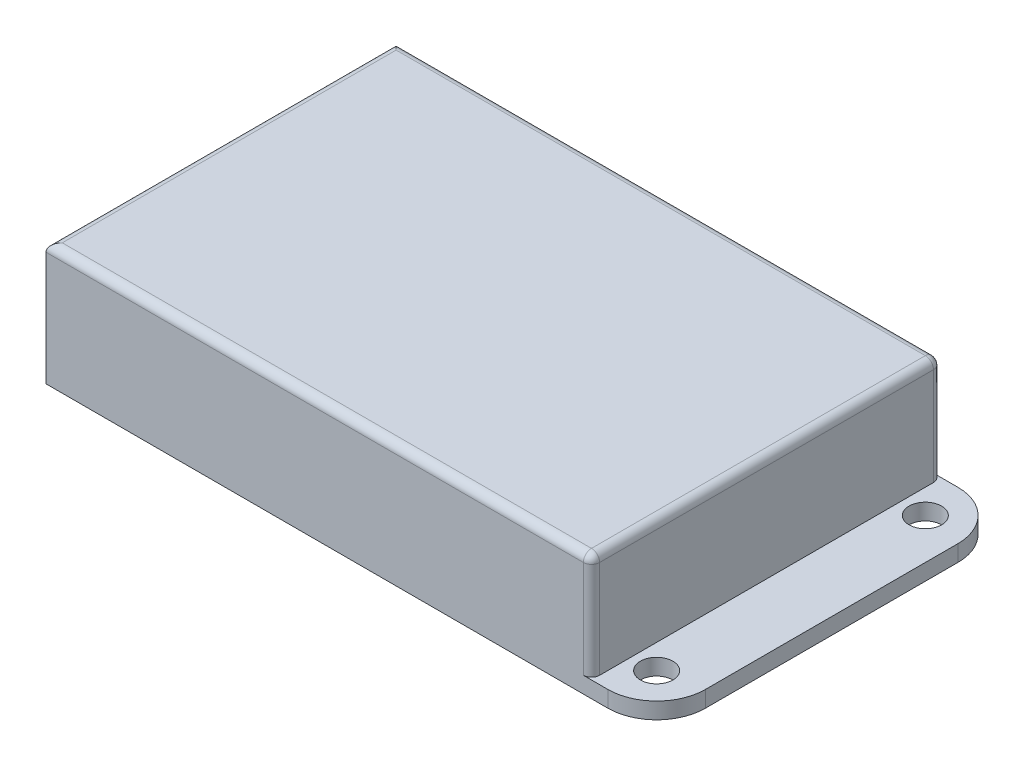
ISO-10303-21;
HEADER;
FILE_DESCRIPTION(('STEP AP214'),'2;1');
FILE_NAME('part.step','',(''),(''),'','','');
FILE_SCHEMA(('AUTOMOTIVE_DESIGN { 1 0 10303 214 1 1 1 1 }'));
ENDSEC;
DATA;
#1=APPLICATION_CONTEXT('core data for automotive mechanical design processes');
#2=APPLICATION_PROTOCOL_DEFINITION('international standard','automotive_design',2000,#1);
#3=PRODUCT_CONTEXT('',#1,'mechanical');
#4=PRODUCT('Part','Part','',(#3));
#5=PRODUCT_RELATED_PRODUCT_CATEGORY('part','',(#4));
#6=PRODUCT_DEFINITION_FORMATION('','',#4);
#7=PRODUCT_DEFINITION_CONTEXT('part definition',#1,'design');
#8=PRODUCT_DEFINITION('design','',#6,#7);
#9=PRODUCT_DEFINITION_SHAPE('','',#8);
#10=(LENGTH_UNIT() NAMED_UNIT(*) SI_UNIT(.MILLI.,.METRE.));
#11=(NAMED_UNIT(*) PLANE_ANGLE_UNIT() SI_UNIT($,.RADIAN.));
#12=(NAMED_UNIT(*) SI_UNIT($,.STERADIAN.) SOLID_ANGLE_UNIT());
#13=UNCERTAINTY_MEASURE_WITH_UNIT(LENGTH_MEASURE(1.E-05),#10,'distance_accuracy_value','');
#14=(GEOMETRIC_REPRESENTATION_CONTEXT(3) GLOBAL_UNCERTAINTY_ASSIGNED_CONTEXT((#13)) GLOBAL_UNIT_ASSIGNED_CONTEXT((#10,
#11,#12)) REPRESENTATION_CONTEXT('',''));
#15=CARTESIAN_POINT('',(0.,0.,0.));
#16=DIRECTION('',(0.,0.,1.));
#17=DIRECTION('',(1.,0.,0.));
#18=AXIS2_PLACEMENT_3D('',#15,#16,#17);
#19=CARTESIAN_POINT('',(0.,2.,0.));
#20=DIRECTION('',(0.,1.,0.));
#21=DIRECTION('',(0.,0.,1.));
#22=AXIS2_PLACEMENT_3D('',#19,#20,#21);
#23=PLANE('',#22);
#24=CARTESIAN_POINT('',(5.,2.,21.500000001011));
#25=DIRECTION('',(0.,1.,0.));
#26=DIRECTION('',(0.,0.,1.));
#27=AXIS2_PLACEMENT_3D('',#24,#25,#26);
#28=CIRCLE('',#27,2.);
#29=CARTESIAN_POINT('',(5.,2.,23.500000001011));
#30=VERTEX_POINT('',#29);
#31=EDGE_CURVE('E331',#30,#30,#28,.T.);
#32=ORIENTED_EDGE('',*,*,#31,.F.);
#33=EDGE_LOOP('',(#32));
#34=FACE_BOUND('',#33,.T.);
#35=DIRECTION('',(0.,0.,1.));
#36=VECTOR('',#35,1.);
#37=CARTESIAN_POINT('',(10.,2.,0.));
#38=LINE('',#37,#36);
#39=CARTESIAN_POINT('',(10.,2.,0.));
#40=VERTEX_POINT('',#39);
#41=CARTESIAN_POINT('',(10.,2.,43.));
#42=VERTEX_POINT('',#41);
#43=EDGE_CURVE('E142',#40,#42,#38,.T.);
#44=ORIENTED_EDGE('',*,*,#43,.F.);
#45=CARTESIAN_POINT('',(10.,2.,0.));
#46=CARTESIAN_POINT('',(-10.,2.,21.5));
#47=CARTESIAN_POINT('',(10.,2.,43.));
#48=B_SPLINE_CURVE_WITH_KNOTS('',2,(#45,#46,#47),.UNSPECIFIED.,.F.,.F.,(3,3),(0.,1.),.UNSPECIFIED.);
#49=EDGE_CURVE('E155',#40,#42,#48,.T.);
#50=ORIENTED_EDGE('',*,*,#49,.T.);
#51=EDGE_LOOP('',(#44,#50));
#52=FACE_BOUND('',#51,.T.);
#53=ADVANCED_FACE('F43',(#34,#52),#23,.T.);
#54=CARTESIAN_POINT('',(0.,2.,0.));
#55=DIRECTION('',(0.,0.,-1.));
#56=DIRECTION('',(-1.,0.,0.));
#57=AXIS2_PLACEMENT_3D('',#54,#55,#56);
#58=PLANE('',#57);
#59=DIRECTION('',(0.,-1.,0.));
#60=VECTOR('',#59,1.);
#61=CARTESIAN_POINT('',(10.,15.,0.));
#62=LINE('',#61,#60);
#63=CARTESIAN_POINT('',(10.,14.,0.));
#64=VERTEX_POINT('',#63);
#65=EDGE_CURVE('E138',#64,#40,#62,.T.);
#66=ORIENTED_EDGE('',*,*,#65,.F.);
#67=DIRECTION('',(-1.,0.,0.));
#68=VECTOR('',#67,1.);
#69=CARTESIAN_POINT('',(0.,14.,0.));
#70=LINE('',#69,#68);
#71=CARTESIAN_POINT('',(76.,14.,0.));
#72=VERTEX_POINT('',#71);
#73=EDGE_CURVE('E295',#64,#72,#70,.F.);
#74=ORIENTED_EDGE('',*,*,#73,.T.);
#75=DIRECTION('',(0.,-1.,0.));
#76=VECTOR('',#75,1.);
#77=CARTESIAN_POINT('',(76.,2.,0.));
#78=LINE('',#77,#76);
#79=CARTESIAN_POINT('',(76.,2.,0.));
#80=VERTEX_POINT('',#79);
#81=EDGE_CURVE('E292',#72,#80,#78,.T.);
#82=ORIENTED_EDGE('',*,*,#81,.T.);
#83=DIRECTION('',(1.,0.,0.));
#84=VECTOR('',#83,1.);
#85=CARTESIAN_POINT('',(0.,2.,0.));
#86=LINE('',#85,#84);
#87=CARTESIAN_POINT('',(79.,2.,0.));
#88=VERTEX_POINT('',#87);
#89=EDGE_CURVE('E172',#80,#88,#86,.T.);
#90=ORIENTED_EDGE('',*,*,#89,.T.);
#91=DIRECTION('',(0.,-1.,0.));
#92=VECTOR('',#91,1.);
#93=CARTESIAN_POINT('',(79.,2.,0.));
#94=LINE('',#93,#92);
#95=CARTESIAN_POINT('',(79.,0.,0.));
#96=VERTEX_POINT('',#95);
#97=EDGE_CURVE('E167',#88,#96,#94,.T.);
#98=ORIENTED_EDGE('',*,*,#97,.T.);
#99=DIRECTION('',(1.,0.,0.));
#100=VECTOR('',#99,1.);
#101=CARTESIAN_POINT('',(0.,0.,0.));
#102=LINE('',#101,#100);
#103=CARTESIAN_POINT('',(10.,0.,0.));
#104=VERTEX_POINT('',#103);
#105=EDGE_CURVE('E164',#104,#96,#102,.T.);
#106=ORIENTED_EDGE('',*,*,#105,.F.);
#107=DIRECTION('',(0.,-1.,0.));
#108=VECTOR('',#107,1.);
#109=CARTESIAN_POINT('',(10.,2.,0.));
#110=LINE('',#109,#108);
#111=EDGE_CURVE('E160',#40,#104,#110,.T.);
#112=ORIENTED_EDGE('',*,*,#111,.F.);
#113=EDGE_LOOP('',(#66,#74,#82,#90,#98,#106,#112));
#114=FACE_BOUND('',#113,.T.);
#115=ADVANCED_FACE('F161',(#114),#58,.T.);
#116=DIRECTION('',(0.,-1.,0.));
#117=VECTOR('',#116,1.);
#118=SURFACE_OF_LINEAR_EXTRUSION('',#48,#117);
#119=CARTESIAN_POINT('',(10.,0.,0.));
#120=CARTESIAN_POINT('',(-10.,0.,21.5));
#121=CARTESIAN_POINT('',(10.,0.,43.));
#122=B_SPLINE_CURVE_WITH_KNOTS('',2,(#119,#120,#121),.UNSPECIFIED.,.F.,.F.,(3,3),(0.,1.),.UNSPECIFIED.);
#123=CARTESIAN_POINT('',(10.,0.,43.));
#124=VERTEX_POINT('',#123);
#125=EDGE_CURVE('E341',#104,#124,#122,.T.);
#126=ORIENTED_EDGE('',*,*,#125,.T.);
#127=DIRECTION('',(0.,-1.,0.));
#128=VECTOR('',#127,1.);
#129=CARTESIAN_POINT('',(10.,2.,43.));
#130=LINE('',#129,#128);
#131=EDGE_CURVE('E168',#42,#124,#130,.T.);
#132=ORIENTED_EDGE('',*,*,#131,.F.);
#133=ORIENTED_EDGE('',*,*,#49,.F.);
#134=ORIENTED_EDGE('',*,*,#111,.T.);
#135=EDGE_LOOP('',(#126,#132,#133,#134));
#136=FACE_BOUND('',#135,.T.);
#137=ADVANCED_FACE('F170',(#136),#118,.F.);
#138=CARTESIAN_POINT('',(0.,2.,43.));
#139=DIRECTION('',(0.,0.,-1.));
#140=DIRECTION('',(-1.,0.,0.));
#141=AXIS2_PLACEMENT_3D('',#138,#139,#140);
#142=PLANE('',#141);
#143=DIRECTION('',(0.,-1.,0.));
#144=VECTOR('',#143,1.);
#145=CARTESIAN_POINT('',(76.,2.,43.));
#146=LINE('',#145,#144);
#147=CARTESIAN_POINT('',(76.,2.,43.));
#148=VERTEX_POINT('',#147);
#149=CARTESIAN_POINT('',(76.,14.,43.));
#150=VERTEX_POINT('',#149);
#151=EDGE_CURVE('E60',#148,#150,#146,.F.);
#152=ORIENTED_EDGE('',*,*,#151,.T.);
#153=DIRECTION('',(1.,0.,0.));
#154=VECTOR('',#153,1.);
#155=CARTESIAN_POINT('',(10.,14.,43.));
#156=LINE('',#155,#154);
#157=CARTESIAN_POINT('',(10.,14.,43.));
#158=VERTEX_POINT('',#157);
#159=EDGE_CURVE('E304',#150,#158,#156,.F.);
#160=ORIENTED_EDGE('',*,*,#159,.T.);
#161=DIRECTION('',(0.,-1.,0.));
#162=VECTOR('',#161,1.);
#163=CARTESIAN_POINT('',(10.,15.,43.));
#164=LINE('',#163,#162);
#165=EDGE_CURVE('E149',#158,#42,#164,.T.);
#166=ORIENTED_EDGE('',*,*,#165,.T.);
#167=ORIENTED_EDGE('',*,*,#131,.T.);
#168=DIRECTION('',(1.,0.,0.));
#169=VECTOR('',#168,1.);
#170=CARTESIAN_POINT('',(0.,0.,43.));
#171=LINE('',#170,#169);
#172=CARTESIAN_POINT('',(79.,0.,43.));
#173=VERTEX_POINT('',#172);
#174=EDGE_CURVE('E344',#124,#173,#171,.T.);
#175=ORIENTED_EDGE('',*,*,#174,.T.);
#176=DIRECTION('',(0.,-1.,0.));
#177=VECTOR('',#176,1.);
#178=CARTESIAN_POINT('',(79.,2.,43.));
#179=LINE('',#178,#177);
#180=CARTESIAN_POINT('',(79.,2.,43.));
#181=VERTEX_POINT('',#180);
#182=EDGE_CURVE('E277',#173,#181,#179,.F.);
#183=ORIENTED_EDGE('',*,*,#182,.T.);
#184=DIRECTION('',(1.,0.,0.));
#185=VECTOR('',#184,1.);
#186=CARTESIAN_POINT('',(0.,2.,43.));
#187=LINE('',#186,#185);
#188=EDGE_CURVE('E65',#148,#181,#187,.T.);
#189=ORIENTED_EDGE('',*,*,#188,.F.);
#190=EDGE_LOOP('',(#152,#160,#166,#167,#175,#183,#189));
#191=FACE_BOUND('',#190,.T.);
#192=ADVANCED_FACE('F191',(#191),#142,.F.);
#193=CARTESIAN_POINT('',(85.,2.,0.));
#194=DIRECTION('',(1.,0.,0.));
#195=DIRECTION('',(0.,0.,-1.));
#196=AXIS2_PLACEMENT_3D('',#193,#194,#195);
#197=PLANE('',#196);
#198=DIRECTION('',(0.,0.,1.));
#199=VECTOR('',#198,1.);
#200=CARTESIAN_POINT('',(85.,0.,0.));
#201=LINE('',#200,#199);
#202=CARTESIAN_POINT('',(85.,0.,6.));
#203=VERTEX_POINT('',#202);
#204=CARTESIAN_POINT('',(85.,0.,37.));
#205=VERTEX_POINT('',#204);
#206=EDGE_CURVE('E177',#203,#205,#201,.T.);
#207=ORIENTED_EDGE('',*,*,#206,.F.);
#208=DIRECTION('',(0.,-1.,0.));
#209=VECTOR('',#208,1.);
#210=CARTESIAN_POINT('',(85.,2.,6.));
#211=LINE('',#210,#209);
#212=CARTESIAN_POINT('',(85.,2.,6.));
#213=VERTEX_POINT('',#212);
#214=EDGE_CURVE('E276',#203,#213,#211,.F.);
#215=ORIENTED_EDGE('',*,*,#214,.T.);
#216=DIRECTION('',(0.,0.,1.));
#217=VECTOR('',#216,1.);
#218=CARTESIAN_POINT('',(85.,2.,0.));
#219=LINE('',#218,#217);
#220=CARTESIAN_POINT('',(85.,2.,37.));
#221=VERTEX_POINT('',#220);
#222=EDGE_CURVE('E174',#213,#221,#219,.T.);
#223=ORIENTED_EDGE('',*,*,#222,.T.);
#224=DIRECTION('',(0.,-1.,0.));
#225=VECTOR('',#224,1.);
#226=CARTESIAN_POINT('',(85.,0.,37.));
#227=LINE('',#226,#225);
#228=EDGE_CURVE('E362',#221,#205,#227,.T.);
#229=ORIENTED_EDGE('',*,*,#228,.T.);
#230=EDGE_LOOP('',(#207,#215,#223,#229));
#231=FACE_BOUND('',#230,.T.);
#232=ADVANCED_FACE('F248',(#231),#197,.T.);
#233=CARTESIAN_POINT('',(80.,2.,5.));
#234=DIRECTION('',(0.,1.,0.));
#235=DIRECTION('',(0.,0.,1.));
#236=AXIS2_PLACEMENT_3D('',#233,#234,#235);
#237=CIRCLE('',#236,2.);
#238=CARTESIAN_POINT('',(80.,2.,6.99999999999999));
#239=VERTEX_POINT('',#238);
#240=EDGE_CURVE('E261',#239,#239,#237,.T.);
#241=ORIENTED_EDGE('',*,*,#240,.F.);
#242=EDGE_LOOP('',(#241));
#243=FACE_BOUND('',#242,.T.);
#244=CARTESIAN_POINT('',(80.,2.,38.));
#245=DIRECTION('',(0.,1.,0.));
#246=DIRECTION('',(0.,0.,1.));
#247=AXIS2_PLACEMENT_3D('',#244,#245,#246);
#248=CIRCLE('',#247,2.);
#249=CARTESIAN_POINT('',(80.,2.,40.));
#250=VERTEX_POINT('',#249);
#251=EDGE_CURVE('E265',#250,#250,#248,.T.);
#252=ORIENTED_EDGE('',*,*,#251,.F.);
#253=EDGE_LOOP('',(#252));
#254=FACE_BOUND('',#253,.T.);
#255=ORIENTED_EDGE('',*,*,#222,.F.);
#256=CARTESIAN_POINT('',(79.,2.,6.));
#257=DIRECTION('',(0.,1.,0.));
#258=DIRECTION('',(0.,0.,1.));
#259=AXIS2_PLACEMENT_3D('',#256,#257,#258);
#260=CIRCLE('',#259,6.);
#261=EDGE_CURVE('E269',#213,#88,#260,.T.);
#262=ORIENTED_EDGE('',*,*,#261,.T.);
#263=ORIENTED_EDGE('',*,*,#89,.F.);
#264=CARTESIAN_POINT('',(76.,2.,1.));
#265=DIRECTION('',(0.,1.,0.));
#266=DIRECTION('',(0.,0.,1.));
#267=AXIS2_PLACEMENT_3D('',#264,#265,#266);
#268=CIRCLE('',#267,1.);
#269=CARTESIAN_POINT('',(77.,2.,1.));
#270=VERTEX_POINT('',#269);
#271=EDGE_CURVE('E52',#80,#270,#268,.F.);
#272=ORIENTED_EDGE('',*,*,#271,.T.);
#273=DIRECTION('',(0.,0.,-1.));
#274=VECTOR('',#273,1.);
#275=CARTESIAN_POINT('',(77.,2.,0.));
#276=LINE('',#275,#274);
#277=CARTESIAN_POINT('',(77.,2.,42.));
#278=VERTEX_POINT('',#277);
#279=EDGE_CURVE('E150',#278,#270,#276,.T.);
#280=ORIENTED_EDGE('',*,*,#279,.F.);
#281=CARTESIAN_POINT('',(76.,2.,42.));
#282=DIRECTION('',(0.,1.,0.));
#283=DIRECTION('',(0.,0.,1.));
#284=AXIS2_PLACEMENT_3D('',#281,#282,#283);
#285=CIRCLE('',#284,1.);
#286=EDGE_CURVE('E11',#278,#148,#285,.F.);
#287=ORIENTED_EDGE('',*,*,#286,.T.);
#288=ORIENTED_EDGE('',*,*,#188,.T.);
#289=CARTESIAN_POINT('',(79.,2.,37.));
#290=DIRECTION('',(0.,1.,0.));
#291=DIRECTION('',(0.,0.,1.));
#292=AXIS2_PLACEMENT_3D('',#289,#290,#291);
#293=CIRCLE('',#292,6.);
#294=EDGE_CURVE('E271',#181,#221,#293,.T.);
#295=ORIENTED_EDGE('',*,*,#294,.T.);
#296=EDGE_LOOP('',(#255,#262,#263,#272,#280,#287,#288,#295));
#297=FACE_BOUND('',#296,.T.);
#298=ADVANCED_FACE('F238',(#243,#254,#297),#23,.T.);
#299=CARTESIAN_POINT('',(0.,0.,0.));
#300=DIRECTION('',(0.,1.,0.));
#301=DIRECTION('',(0.,0.,1.));
#302=AXIS2_PLACEMENT_3D('',#299,#300,#301);
#303=PLANE('',#302);
#304=CARTESIAN_POINT('',(80.,0.,5.));
#305=DIRECTION('',(0.,1.,0.));
#306=DIRECTION('',(0.,0.,1.));
#307=AXIS2_PLACEMENT_3D('',#304,#305,#306);
#308=CIRCLE('',#307,2.);
#309=CARTESIAN_POINT('',(80.,0.,6.99999999999999));
#310=VERTEX_POINT('',#309);
#311=EDGE_CURVE('E157',#310,#310,#308,.T.);
#312=ORIENTED_EDGE('',*,*,#311,.T.);
#313=EDGE_LOOP('',(#312));
#314=FACE_BOUND('',#313,.T.);
#315=CARTESIAN_POINT('',(80.,0.,38.));
#316=DIRECTION('',(0.,1.,0.));
#317=DIRECTION('',(0.,0.,1.));
#318=AXIS2_PLACEMENT_3D('',#315,#316,#317);
#319=CIRCLE('',#318,2.);
#320=CARTESIAN_POINT('',(80.,0.,40.));
#321=VERTEX_POINT('',#320);
#322=EDGE_CURVE('E336',#321,#321,#319,.T.);
#323=ORIENTED_EDGE('',*,*,#322,.T.);
#324=EDGE_LOOP('',(#323));
#325=FACE_BOUND('',#324,.T.);
#326=CARTESIAN_POINT('',(5.,0.,21.500000001011));
#327=DIRECTION('',(0.,1.,0.));
#328=DIRECTION('',(0.,0.,1.));
#329=AXIS2_PLACEMENT_3D('',#326,#327,#328);
#330=CIRCLE('',#329,2.);
#331=CARTESIAN_POINT('',(5.,0.,23.500000001011));
#332=VERTEX_POINT('',#331);
#333=EDGE_CURVE('E329',#332,#332,#330,.T.);
#334=ORIENTED_EDGE('',*,*,#333,.T.);
#335=EDGE_LOOP('',(#334));
#336=FACE_BOUND('',#335,.T.);
#337=ORIENTED_EDGE('',*,*,#105,.T.);
#338=CARTESIAN_POINT('',(79.,0.,6.));
#339=DIRECTION('',(0.,1.,0.));
#340=DIRECTION('',(0.,0.,1.));
#341=AXIS2_PLACEMENT_3D('',#338,#339,#340);
#342=CIRCLE('',#341,6.);
#343=EDGE_CURVE('E360',#96,#203,#342,.F.);
#344=ORIENTED_EDGE('',*,*,#343,.T.);
#345=ORIENTED_EDGE('',*,*,#206,.T.);
#346=CARTESIAN_POINT('',(79.,0.,37.));
#347=DIRECTION('',(0.,1.,0.));
#348=DIRECTION('',(0.,0.,1.));
#349=AXIS2_PLACEMENT_3D('',#346,#347,#348);
#350=CIRCLE('',#349,6.);
#351=EDGE_CURVE('E358',#205,#173,#350,.F.);
#352=ORIENTED_EDGE('',*,*,#351,.T.);
#353=ORIENTED_EDGE('',*,*,#174,.F.);
#354=ORIENTED_EDGE('',*,*,#125,.F.);
#355=EDGE_LOOP('',(#337,#344,#345,#352,#353,#354));
#356=FACE_BOUND('',#355,.T.);
#357=ADVANCED_FACE('F247',(#314,#325,#336,#356),#303,.F.);
#358=CARTESIAN_POINT('',(10.,15.,0.));
#359=DIRECTION('',(1.,0.,0.));
#360=DIRECTION('',(0.,0.,-1.));
#361=AXIS2_PLACEMENT_3D('',#358,#359,#360);
#362=PLANE('',#361);
#363=ORIENTED_EDGE('',*,*,#165,.F.);
#364=DIRECTION('',(0.,0.,1.));
#365=VECTOR('',#364,1.);
#366=CARTESIAN_POINT('',(10.,14.,0.));
#367=LINE('',#366,#365);
#368=EDGE_CURVE('E144',#158,#64,#367,.F.);
#369=ORIENTED_EDGE('',*,*,#368,.T.);
#370=ORIENTED_EDGE('',*,*,#65,.T.);
#371=ORIENTED_EDGE('',*,*,#43,.T.);
#372=EDGE_LOOP('',(#363,#369,#370,#371));
#373=FACE_BOUND('',#372,.T.);
#374=ADVANCED_FACE('F141',(#373),#362,.F.);
#375=CARTESIAN_POINT('',(77.,15.,0.));
#376=DIRECTION('',(-1.,0.,0.));
#377=DIRECTION('',(0.,0.,1.));
#378=AXIS2_PLACEMENT_3D('',#375,#376,#377);
#379=PLANE('',#378);
#380=ORIENTED_EDGE('',*,*,#279,.T.);
#381=DIRECTION('',(0.,-1.,0.));
#382=VECTOR('',#381,1.);
#383=CARTESIAN_POINT('',(77.,15.,1.));
#384=LINE('',#383,#382);
#385=CARTESIAN_POINT('',(77.,14.,1.));
#386=VERTEX_POINT('',#385);
#387=EDGE_CURVE('E301',#270,#386,#384,.F.);
#388=ORIENTED_EDGE('',*,*,#387,.T.);
#389=DIRECTION('',(0.,0.,-1.));
#390=VECTOR('',#389,1.);
#391=CARTESIAN_POINT('',(77.,14.,43.));
#392=LINE('',#391,#390);
#393=CARTESIAN_POINT('',(77.,14.,42.));
#394=VERTEX_POINT('',#393);
#395=EDGE_CURVE('E299',#386,#394,#392,.F.);
#396=ORIENTED_EDGE('',*,*,#395,.T.);
#397=DIRECTION('',(0.,-1.,0.));
#398=VECTOR('',#397,1.);
#399=CARTESIAN_POINT('',(77.,15.,42.));
#400=LINE('',#399,#398);
#401=EDGE_CURVE('E297',#394,#278,#400,.T.);
#402=ORIENTED_EDGE('',*,*,#401,.T.);
#403=EDGE_LOOP('',(#380,#388,#396,#402));
#404=FACE_BOUND('',#403,.T.);
#405=ADVANCED_FACE('F371',(#404),#379,.F.);
#406=CARTESIAN_POINT('',(0.,15.,0.));
#407=DIRECTION('',(0.,1.,0.));
#408=DIRECTION('',(0.,0.,1.));
#409=AXIS2_PLACEMENT_3D('',#406,#407,#408);
#410=PLANE('',#409);
#411=DIRECTION('',(0.,0.,-1.));
#412=VECTOR('',#411,1.);
#413=CARTESIAN_POINT('',(76.,15.,0.));
#414=LINE('',#413,#412);
#415=CARTESIAN_POINT('',(76.,15.,42.));
#416=VERTEX_POINT('',#415);
#417=CARTESIAN_POINT('',(76.,15.,1.));
#418=VERTEX_POINT('',#417);
#419=EDGE_CURVE('E287',#416,#418,#414,.T.);
#420=ORIENTED_EDGE('',*,*,#419,.T.);
#421=DIRECTION('',(-1.,0.,0.));
#422=VECTOR('',#421,1.);
#423=CARTESIAN_POINT('',(0.,15.,1.));
#424=LINE('',#423,#422);
#425=CARTESIAN_POINT('',(11.,15.,1.));
#426=VERTEX_POINT('',#425);
#427=EDGE_CURVE('E289',#418,#426,#424,.T.);
#428=ORIENTED_EDGE('',*,*,#427,.T.);
#429=DIRECTION('',(0.,0.,1.));
#430=VECTOR('',#429,1.);
#431=CARTESIAN_POINT('',(11.,15.,43.));
#432=LINE('',#431,#430);
#433=CARTESIAN_POINT('',(11.,15.,42.));
#434=VERTEX_POINT('',#433);
#435=EDGE_CURVE('E279',#426,#434,#432,.T.);
#436=ORIENTED_EDGE('',*,*,#435,.T.);
#437=DIRECTION('',(1.,0.,0.));
#438=VECTOR('',#437,1.);
#439=CARTESIAN_POINT('',(77.,15.,42.));
#440=LINE('',#439,#438);
#441=EDGE_CURVE('E285',#434,#416,#440,.T.);
#442=ORIENTED_EDGE('',*,*,#441,.T.);
#443=EDGE_LOOP('',(#420,#428,#436,#442));
#444=FACE_BOUND('',#443,.T.);
#445=ADVANCED_FACE('F435',(#444),#410,.T.);
#446=CARTESIAN_POINT('',(5.,0.,21.500000001011));
#447=DIRECTION('',(0.,1.,0.));
#448=DIRECTION('',(0.,0.,1.));
#449=AXIS2_PLACEMENT_3D('',#446,#447,#448);
#450=CYLINDRICAL_SURFACE('',#449,2.);
#451=ORIENTED_EDGE('',*,*,#333,.F.);
#452=EDGE_LOOP('',(#451));
#453=FACE_BOUND('',#452,.T.);
#454=ORIENTED_EDGE('',*,*,#31,.T.);
#455=EDGE_LOOP('',(#454));
#456=FACE_BOUND('',#455,.T.);
#457=ADVANCED_FACE('F425',(#453,#456),#450,.F.);
#458=CARTESIAN_POINT('',(80.,0.,38.));
#459=DIRECTION('',(0.,1.,0.));
#460=DIRECTION('',(0.,0.,1.));
#461=AXIS2_PLACEMENT_3D('',#458,#459,#460);
#462=CYLINDRICAL_SURFACE('',#461,2.);
#463=ORIENTED_EDGE('',*,*,#322,.F.);
#464=EDGE_LOOP('',(#463));
#465=FACE_BOUND('',#464,.T.);
#466=ORIENTED_EDGE('',*,*,#251,.T.);
#467=EDGE_LOOP('',(#466));
#468=FACE_BOUND('',#467,.T.);
#469=ADVANCED_FACE('F415',(#465,#468),#462,.F.);
#470=CARTESIAN_POINT('',(80.,0.,5.));
#471=DIRECTION('',(0.,1.,0.));
#472=DIRECTION('',(0.,0.,1.));
#473=AXIS2_PLACEMENT_3D('',#470,#471,#472);
#474=CYLINDRICAL_SURFACE('',#473,2.);
#475=ORIENTED_EDGE('',*,*,#311,.F.);
#476=EDGE_LOOP('',(#475));
#477=FACE_BOUND('',#476,.T.);
#478=ORIENTED_EDGE('',*,*,#240,.T.);
#479=EDGE_LOOP('',(#478));
#480=FACE_BOUND('',#479,.T.);
#481=ADVANCED_FACE('F199',(#477,#480),#474,.F.);
#482=CARTESIAN_POINT('',(79.,2.,6.));
#483=DIRECTION('',(0.,-1.,0.));
#484=DIRECTION('',(0.,0.,-1.));
#485=AXIS2_PLACEMENT_3D('',#482,#483,#484);
#486=CYLINDRICAL_SURFACE('',#485,6.);
#487=ORIENTED_EDGE('',*,*,#261,.F.);
#488=ORIENTED_EDGE('',*,*,#214,.F.);
#489=ORIENTED_EDGE('',*,*,#343,.F.);
#490=ORIENTED_EDGE('',*,*,#97,.F.);
#491=EDGE_LOOP('',(#487,#488,#489,#490));
#492=FACE_BOUND('',#491,.T.);
#493=ADVANCED_FACE('F195',(#492),#486,.T.);
#494=CARTESIAN_POINT('',(79.,2.,37.));
#495=DIRECTION('',(0.,1.,0.));
#496=DIRECTION('',(0.,0.,1.));
#497=AXIS2_PLACEMENT_3D('',#494,#495,#496);
#498=CYLINDRICAL_SURFACE('',#497,6.);
#499=ORIENTED_EDGE('',*,*,#294,.F.);
#500=ORIENTED_EDGE('',*,*,#182,.F.);
#501=ORIENTED_EDGE('',*,*,#351,.F.);
#502=ORIENTED_EDGE('',*,*,#228,.F.);
#503=EDGE_LOOP('',(#499,#500,#501,#502));
#504=FACE_BOUND('',#503,.T.);
#505=ADVANCED_FACE('F198',(#504),#498,.T.);
#506=CARTESIAN_POINT('',(76.,15.,42.));
#507=DIRECTION('',(0.,-1.,0.));
#508=DIRECTION('',(0.,0.,-1.));
#509=AXIS2_PLACEMENT_3D('',#506,#507,#508);
#510=CYLINDRICAL_SURFACE('',#509,1.);
#511=CARTESIAN_POINT('',(76.,14.,42.));
#512=DIRECTION('',(0.,1.,0.));
#513=DIRECTION('',(0.,0.,1.));
#514=AXIS2_PLACEMENT_3D('',#511,#512,#513);
#515=CIRCLE('',#514,1.);
#516=EDGE_CURVE('E47',#150,#394,#515,.T.);
#517=ORIENTED_EDGE('',*,*,#516,.F.);
#518=ORIENTED_EDGE('',*,*,#151,.F.);
#519=ORIENTED_EDGE('',*,*,#286,.F.);
#520=ORIENTED_EDGE('',*,*,#401,.F.);
#521=EDGE_LOOP('',(#517,#518,#519,#520));
#522=FACE_BOUND('',#521,.T.);
#523=ADVANCED_FACE('F45',(#522),#510,.T.);
#524=CARTESIAN_POINT('',(76.,14.,42.));
#525=DIRECTION('',(1.,0.,0.));
#526=DIRECTION('',(0.,0.,-1.));
#527=AXIS2_PLACEMENT_3D('',#524,#525,#526);
#528=SPHERICAL_SURFACE('',#527,1.);
#529=CARTESIAN_POINT('',(76.,14.,42.));
#530=DIRECTION('',(1.,0.,0.));
#531=DIRECTION('',(0.,0.,-1.));
#532=AXIS2_PLACEMENT_3D('',#529,#530,#531);
#533=CIRCLE('',#532,1.);
#534=EDGE_CURVE('E321',#150,#416,#533,.F.);
#535=ORIENTED_EDGE('',*,*,#534,.F.);
#536=ORIENTED_EDGE('',*,*,#516,.T.);
#537=CARTESIAN_POINT('',(76.,14.,42.));
#538=DIRECTION('',(0.,0.,1.));
#539=DIRECTION('',(1.,0.,0.));
#540=AXIS2_PLACEMENT_3D('',#537,#538,#539);
#541=CIRCLE('',#540,1.);
#542=EDGE_CURVE('E323',#416,#394,#541,.F.);
#543=ORIENTED_EDGE('',*,*,#542,.F.);
#544=EDGE_LOOP('',(#535,#536,#543));
#545=FACE_BOUND('',#544,.T.);
#546=ADVANCED_FACE('F226',(#545),#528,.T.);
#547=CARTESIAN_POINT('',(76.,2.,1.));
#548=DIRECTION('',(0.,1.,0.));
#549=DIRECTION('',(0.,0.,1.));
#550=AXIS2_PLACEMENT_3D('',#547,#548,#549);
#551=CYLINDRICAL_SURFACE('',#550,1.);
#552=ORIENTED_EDGE('',*,*,#271,.F.);
#553=ORIENTED_EDGE('',*,*,#81,.F.);
#554=CARTESIAN_POINT('',(76.,14.,1.));
#555=DIRECTION('',(0.,1.,0.));
#556=DIRECTION('',(0.,0.,1.));
#557=AXIS2_PLACEMENT_3D('',#554,#555,#556);
#558=CIRCLE('',#557,1.);
#559=EDGE_CURVE('E318',#386,#72,#558,.T.);
#560=ORIENTED_EDGE('',*,*,#559,.F.);
#561=ORIENTED_EDGE('',*,*,#387,.F.);
#562=EDGE_LOOP('',(#552,#553,#560,#561));
#563=FACE_BOUND('',#562,.T.);
#564=ADVANCED_FACE('F223',(#563),#551,.T.);
#565=CARTESIAN_POINT('',(76.,14.,0.));
#566=DIRECTION('',(0.,0.,1.));
#567=DIRECTION('',(1.,0.,0.));
#568=AXIS2_PLACEMENT_3D('',#565,#566,#567);
#569=CYLINDRICAL_SURFACE('',#568,1.);
#570=ORIENTED_EDGE('',*,*,#542,.T.);
#571=ORIENTED_EDGE('',*,*,#395,.F.);
#572=CARTESIAN_POINT('',(76.,14.,1.));
#573=DIRECTION('',(0.,0.,-1.));
#574=DIRECTION('',(-1.,0.,0.));
#575=AXIS2_PLACEMENT_3D('',#572,#573,#574);
#576=CIRCLE('',#575,1.);
#577=EDGE_CURVE('E315',#418,#386,#576,.T.);
#578=ORIENTED_EDGE('',*,*,#577,.F.);
#579=ORIENTED_EDGE('',*,*,#419,.F.);
#580=EDGE_LOOP('',(#570,#571,#578,#579));
#581=FACE_BOUND('',#580,.T.);
#582=ADVANCED_FACE('F219',(#581),#569,.T.);
#583=CARTESIAN_POINT('',(0.,14.,42.));
#584=DIRECTION('',(-1.,0.,0.));
#585=DIRECTION('',(0.,0.,1.));
#586=AXIS2_PLACEMENT_3D('',#583,#584,#585);
#587=CYLINDRICAL_SURFACE('',#586,1.);
#588=ORIENTED_EDGE('',*,*,#534,.T.);
#589=ORIENTED_EDGE('',*,*,#441,.F.);
#590=CARTESIAN_POINT('',(11.,14.,42.));
#591=DIRECTION('',(-0.707106781186548,0.,-0.707106781186547));
#592=DIRECTION('',(0.707106781186547,0.,-0.707106781186548));
#593=AXIS2_PLACEMENT_3D('',#590,#591,#592);
#594=ELLIPSE('',#593,1.41421356237309,1.);
#595=EDGE_CURVE('E312',#158,#434,#594,.T.);
#596=ORIENTED_EDGE('',*,*,#595,.F.);
#597=ORIENTED_EDGE('',*,*,#159,.F.);
#598=EDGE_LOOP('',(#588,#589,#596,#597));
#599=FACE_BOUND('',#598,.T.);
#600=ADVANCED_FACE('F215',(#599),#587,.T.);
#601=CARTESIAN_POINT('',(76.,14.,1.));
#602=DIRECTION('',(1.,0.,0.));
#603=DIRECTION('',(0.,0.,-1.));
#604=AXIS2_PLACEMENT_3D('',#601,#602,#603);
#605=SPHERICAL_SURFACE('',#604,1.);
#606=ORIENTED_EDGE('',*,*,#577,.T.);
#607=ORIENTED_EDGE('',*,*,#559,.T.);
#608=CARTESIAN_POINT('',(76.,14.,1.));
#609=DIRECTION('',(1.,0.,0.));
#610=DIRECTION('',(0.,0.,-1.));
#611=AXIS2_PLACEMENT_3D('',#608,#609,#610);
#612=CIRCLE('',#611,1.);
#613=EDGE_CURVE('E310',#418,#72,#612,.F.);
#614=ORIENTED_EDGE('',*,*,#613,.F.);
#615=EDGE_LOOP('',(#606,#607,#614));
#616=FACE_BOUND('',#615,.T.);
#617=ADVANCED_FACE('F211',(#616),#605,.T.);
#618=CARTESIAN_POINT('',(11.,14.,0.));
#619=DIRECTION('',(0.,0.,-1.));
#620=DIRECTION('',(-1.,0.,0.));
#621=AXIS2_PLACEMENT_3D('',#618,#619,#620);
#622=CYLINDRICAL_SURFACE('',#621,1.);
#623=ORIENTED_EDGE('',*,*,#595,.T.);
#624=ORIENTED_EDGE('',*,*,#435,.F.);
#625=CARTESIAN_POINT('',(11.,14.,1.));
#626=DIRECTION('',(0.707106781186547,0.,-0.707106781186548));
#627=DIRECTION('',(-0.707106781186548,0.,-0.707106781186547));
#628=AXIS2_PLACEMENT_3D('',#625,#626,#627);
#629=ELLIPSE('',#628,1.4142135623731,1.);
#630=EDGE_CURVE('E308',#64,#426,#629,.T.);
#631=ORIENTED_EDGE('',*,*,#630,.F.);
#632=ORIENTED_EDGE('',*,*,#368,.F.);
#633=EDGE_LOOP('',(#623,#624,#631,#632));
#634=FACE_BOUND('',#633,.T.);
#635=ADVANCED_FACE('F207',(#634),#622,.T.);
#636=CARTESIAN_POINT('',(0.,14.,1.));
#637=DIRECTION('',(-1.,0.,0.));
#638=DIRECTION('',(0.,0.,1.));
#639=AXIS2_PLACEMENT_3D('',#636,#637,#638);
#640=CYLINDRICAL_SURFACE('',#639,1.);
#641=ORIENTED_EDGE('',*,*,#613,.T.);
#642=ORIENTED_EDGE('',*,*,#73,.F.);
#643=ORIENTED_EDGE('',*,*,#630,.T.);
#644=ORIENTED_EDGE('',*,*,#427,.F.);
#645=EDGE_LOOP('',(#641,#642,#643,#644));
#646=FACE_BOUND('',#645,.T.);
#647=ADVANCED_FACE('F204',(#646),#640,.T.);
#648=CLOSED_SHELL('',(#53,#115,#137,#192,#232,#298,#357,#374,#405,#445,#457,#469,#481,#493,#505,
#523,#546,#564,#582,#600,#617,#635,#647));
#649=MANIFOLD_SOLID_BREP('B2',#648);
#650=ADVANCED_BREP_SHAPE_REPRESENTATION('',(#18,#649),#14);
#651=SHAPE_DEFINITION_REPRESENTATION(#9,#650);
ENDSEC;
END-ISO-10303-21;
